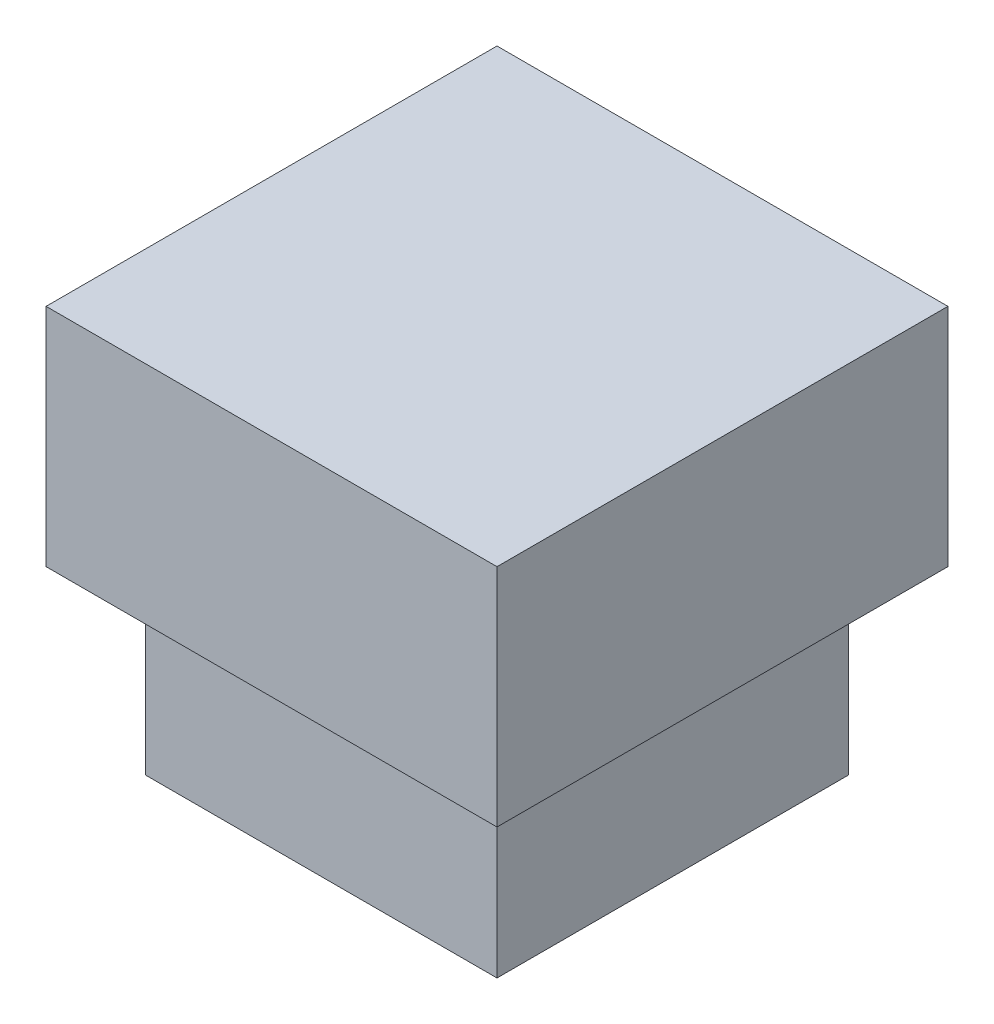
ISO-10303-21;
HEADER;
FILE_DESCRIPTION(('STEP AP214'),'2;1');
FILE_NAME('part.step','',(''),(''),'','','');
FILE_SCHEMA(('AUTOMOTIVE_DESIGN { 1 0 10303 214 1 1 1 1 }'));
ENDSEC;
DATA;
#1=APPLICATION_CONTEXT('core data for automotive mechanical design processes');
#2=APPLICATION_PROTOCOL_DEFINITION('international standard','automotive_design',2000,#1);
#3=PRODUCT_CONTEXT('',#1,'mechanical');
#4=PRODUCT('Part','Part','',(#3));
#5=PRODUCT_RELATED_PRODUCT_CATEGORY('part','',(#4));
#6=PRODUCT_DEFINITION_FORMATION('','',#4);
#7=PRODUCT_DEFINITION_CONTEXT('part definition',#1,'design');
#8=PRODUCT_DEFINITION('design','',#6,#7);
#9=PRODUCT_DEFINITION_SHAPE('','',#8);
#10=(LENGTH_UNIT() NAMED_UNIT(*) SI_UNIT(.MILLI.,.METRE.));
#11=(NAMED_UNIT(*) PLANE_ANGLE_UNIT() SI_UNIT($,.RADIAN.));
#12=(NAMED_UNIT(*) SI_UNIT($,.STERADIAN.) SOLID_ANGLE_UNIT());
#13=UNCERTAINTY_MEASURE_WITH_UNIT(LENGTH_MEASURE(1.E-05),#10,'distance_accuracy_value','');
#14=(GEOMETRIC_REPRESENTATION_CONTEXT(3) GLOBAL_UNCERTAINTY_ASSIGNED_CONTEXT((#13)) GLOBAL_UNIT_ASSIGNED_CONTEXT((#10,
#11,#12)) REPRESENTATION_CONTEXT('',''));
#15=CARTESIAN_POINT('',(0.,0.,0.));
#16=DIRECTION('',(0.,0.,1.));
#17=DIRECTION('',(1.,0.,0.));
#18=AXIS2_PLACEMENT_3D('',#15,#16,#17);
#19=CARTESIAN_POINT('',(1.95,2.,-1.95));
#20=DIRECTION('',(-1.,0.,0.));
#21=DIRECTION('',(0.,0.,1.));
#22=AXIS2_PLACEMENT_3D('',#19,#20,#21);
#23=PLANE('',#22);
#24=DIRECTION('',(0.,0.,-1.));
#25=VECTOR('',#24,1.);
#26=CARTESIAN_POINT('',(1.95,0.,-1.95));
#27=LINE('',#26,#25);
#28=CARTESIAN_POINT('',(1.95,0.,1.95));
#29=VERTEX_POINT('',#28);
#30=CARTESIAN_POINT('',(1.95,0.,-1.95));
#31=VERTEX_POINT('',#30);
#32=EDGE_CURVE('E133',#29,#31,#27,.T.);
#33=ORIENTED_EDGE('',*,*,#32,.T.);
#34=DIRECTION('',(0.,-1.,0.));
#35=VECTOR('',#34,1.);
#36=CARTESIAN_POINT('',(1.95,2.,-1.95));
#37=LINE('',#36,#35);
#38=CARTESIAN_POINT('',(1.95,2.,-1.95));
#39=VERTEX_POINT('',#38);
#40=EDGE_CURVE('E11',#39,#31,#37,.T.);
#41=ORIENTED_EDGE('',*,*,#40,.F.);
#42=DIRECTION('',(0.,0.,-1.));
#43=VECTOR('',#42,1.);
#44=CARTESIAN_POINT('',(1.95,2.,-1.95));
#45=LINE('',#44,#43);
#46=CARTESIAN_POINT('',(1.95,2.,1.95));
#47=VERTEX_POINT('',#46);
#48=EDGE_CURVE('E142',#47,#39,#45,.T.);
#49=ORIENTED_EDGE('',*,*,#48,.F.);
#50=DIRECTION('',(0.,-1.,0.));
#51=VECTOR('',#50,1.);
#52=CARTESIAN_POINT('',(1.95,2.,1.95));
#53=LINE('',#52,#51);
#54=EDGE_CURVE('E151',#47,#29,#53,.T.);
#55=ORIENTED_EDGE('',*,*,#54,.T.);
#56=EDGE_LOOP('',(#33,#41,#49,#55));
#57=FACE_BOUND('',#56,.T.);
#58=ADVANCED_FACE('F35',(#57),#23,.F.);
#59=CARTESIAN_POINT('',(-1.95,2.,-1.95));
#60=DIRECTION('',(0.,0.,1.));
#61=DIRECTION('',(1.,0.,0.));
#62=AXIS2_PLACEMENT_3D('',#59,#60,#61);
#63=PLANE('',#62);
#64=DIRECTION('',(-1.,0.,0.));
#65=VECTOR('',#64,1.);
#66=CARTESIAN_POINT('',(-1.95,0.,-1.95));
#67=LINE('',#66,#65);
#68=CARTESIAN_POINT('',(-1.95,0.,-1.95));
#69=VERTEX_POINT('',#68);
#70=EDGE_CURVE('E136',#31,#69,#67,.T.);
#71=ORIENTED_EDGE('',*,*,#70,.T.);
#72=DIRECTION('',(0.,-1.,0.));
#73=VECTOR('',#72,1.);
#74=CARTESIAN_POINT('',(-1.95,2.,-1.95));
#75=LINE('',#74,#73);
#76=CARTESIAN_POINT('',(-1.95,2.,-1.95));
#77=VERTEX_POINT('',#76);
#78=EDGE_CURVE('E43',#77,#69,#75,.T.);
#79=ORIENTED_EDGE('',*,*,#78,.F.);
#80=DIRECTION('',(-1.,0.,0.));
#81=VECTOR('',#80,1.);
#82=CARTESIAN_POINT('',(-1.95,2.,-1.95));
#83=LINE('',#82,#81);
#84=EDGE_CURVE('E77',#39,#77,#83,.T.);
#85=ORIENTED_EDGE('',*,*,#84,.F.);
#86=ORIENTED_EDGE('',*,*,#40,.T.);
#87=EDGE_LOOP('',(#71,#79,#85,#86));
#88=FACE_BOUND('',#87,.T.);
#89=ADVANCED_FACE('F177',(#88),#63,.F.);
#90=CARTESIAN_POINT('',(-1.95,2.,-1.95));
#91=DIRECTION('',(1.,0.,0.));
#92=DIRECTION('',(0.,0.,-1.));
#93=AXIS2_PLACEMENT_3D('',#90,#91,#92);
#94=PLANE('',#93);
#95=DIRECTION('',(0.,0.,1.));
#96=VECTOR('',#95,1.);
#97=CARTESIAN_POINT('',(-1.95,0.,-1.95));
#98=LINE('',#97,#96);
#99=CARTESIAN_POINT('',(-1.95,0.,1.95));
#100=VERTEX_POINT('',#99);
#101=EDGE_CURVE('E67',#69,#100,#98,.T.);
#102=ORIENTED_EDGE('',*,*,#101,.T.);
#103=DIRECTION('',(0.,-1.,0.));
#104=VECTOR('',#103,1.);
#105=CARTESIAN_POINT('',(-1.95,2.,1.95));
#106=LINE('',#105,#104);
#107=CARTESIAN_POINT('',(-1.95,2.,1.95));
#108=VERTEX_POINT('',#107);
#109=EDGE_CURVE('E51',#108,#100,#106,.T.);
#110=ORIENTED_EDGE('',*,*,#109,.F.);
#111=DIRECTION('',(0.,0.,1.));
#112=VECTOR('',#111,1.);
#113=CARTESIAN_POINT('',(-1.95,2.,-1.95));
#114=LINE('',#113,#112);
#115=EDGE_CURVE('E146',#77,#108,#114,.T.);
#116=ORIENTED_EDGE('',*,*,#115,.F.);
#117=ORIENTED_EDGE('',*,*,#78,.T.);
#118=EDGE_LOOP('',(#102,#110,#116,#117));
#119=FACE_BOUND('',#118,.T.);
#120=ADVANCED_FACE('F157',(#119),#94,.F.);
#121=CARTESIAN_POINT('',(-1.95,2.,1.95));
#122=DIRECTION('',(0.,0.,-1.));
#123=DIRECTION('',(-1.,0.,0.));
#124=AXIS2_PLACEMENT_3D('',#121,#122,#123);
#125=PLANE('',#124);
#126=DIRECTION('',(1.,0.,0.));
#127=VECTOR('',#126,1.);
#128=CARTESIAN_POINT('',(-1.95,0.,1.95));
#129=LINE('',#128,#127);
#130=EDGE_CURVE('E72',#100,#29,#129,.T.);
#131=ORIENTED_EDGE('',*,*,#130,.T.);
#132=ORIENTED_EDGE('',*,*,#54,.F.);
#133=DIRECTION('',(1.,0.,0.));
#134=VECTOR('',#133,1.);
#135=CARTESIAN_POINT('',(-1.95,2.,1.95));
#136=LINE('',#135,#134);
#137=EDGE_CURVE('E149',#108,#47,#136,.T.);
#138=ORIENTED_EDGE('',*,*,#137,.F.);
#139=ORIENTED_EDGE('',*,*,#109,.T.);
#140=EDGE_LOOP('',(#131,#132,#138,#139));
#141=FACE_BOUND('',#140,.T.);
#142=ADVANCED_FACE('F162',(#141),#125,.F.);
#143=CARTESIAN_POINT('',(0.,0.,0.));
#144=DIRECTION('',(0.,1.,0.));
#145=DIRECTION('',(0.,0.,1.));
#146=AXIS2_PLACEMENT_3D('',#143,#144,#145);
#147=PLANE('',#146);
#148=ORIENTED_EDGE('',*,*,#32,.F.);
#149=ORIENTED_EDGE('',*,*,#130,.F.);
#150=ORIENTED_EDGE('',*,*,#101,.F.);
#151=ORIENTED_EDGE('',*,*,#70,.F.);
#152=EDGE_LOOP('',(#148,#149,#150,#151));
#153=FACE_BOUND('',#152,.T.);
#154=ADVANCED_FACE('F160',(#153),#147,.F.);
#155=CARTESIAN_POINT('',(0.,2.,0.));
#156=DIRECTION('',(0.,1.,0.));
#157=DIRECTION('',(0.,0.,1.));
#158=AXIS2_PLACEMENT_3D('',#155,#156,#157);
#159=PLANE('',#158);
#160=DIRECTION('',(0.,0.,-1.));
#161=VECTOR('',#160,1.);
#162=CARTESIAN_POINT('',(2.5,2.,-2.5));
#163=LINE('',#162,#161);
#164=CARTESIAN_POINT('',(2.5,2.,2.5));
#165=VERTEX_POINT('',#164);
#166=CARTESIAN_POINT('',(2.5,2.,-2.5));
#167=VERTEX_POINT('',#166);
#168=EDGE_CURVE('E132',#165,#167,#163,.T.);
#169=ORIENTED_EDGE('',*,*,#168,.F.);
#170=DIRECTION('',(1.,0.,0.));
#171=VECTOR('',#170,1.);
#172=CARTESIAN_POINT('',(-2.5,2.,2.5));
#173=LINE('',#172,#171);
#174=CARTESIAN_POINT('',(-2.5,2.,2.5));
#175=VERTEX_POINT('',#174);
#176=EDGE_CURVE('E128',#175,#165,#173,.T.);
#177=ORIENTED_EDGE('',*,*,#176,.F.);
#178=DIRECTION('',(0.,0.,1.));
#179=VECTOR('',#178,1.);
#180=CARTESIAN_POINT('',(-2.5,2.,-2.5));
#181=LINE('',#180,#179);
#182=CARTESIAN_POINT('',(-2.5,2.,-2.5));
#183=VERTEX_POINT('',#182);
#184=EDGE_CURVE('E204',#183,#175,#181,.T.);
#185=ORIENTED_EDGE('',*,*,#184,.F.);
#186=DIRECTION('',(-1.,0.,0.));
#187=VECTOR('',#186,1.);
#188=CARTESIAN_POINT('',(-2.5,2.,-2.5));
#189=LINE('',#188,#187);
#190=EDGE_CURVE('E207',#167,#183,#189,.T.);
#191=ORIENTED_EDGE('',*,*,#190,.F.);
#192=EDGE_LOOP('',(#169,#177,#185,#191));
#193=FACE_BOUND('',#192,.T.);
#194=ORIENTED_EDGE('',*,*,#137,.T.);
#195=ORIENTED_EDGE('',*,*,#48,.T.);
#196=ORIENTED_EDGE('',*,*,#84,.T.);
#197=ORIENTED_EDGE('',*,*,#115,.T.);
#198=EDGE_LOOP('',(#194,#195,#196,#197));
#199=FACE_BOUND('',#198,.T.);
#200=ADVANCED_FACE('F164',(#193,#199),#159,.F.);
#201=CARTESIAN_POINT('',(2.5,4.5,-2.5));
#202=DIRECTION('',(-1.,0.,0.));
#203=DIRECTION('',(0.,0.,1.));
#204=AXIS2_PLACEMENT_3D('',#201,#202,#203);
#205=PLANE('',#204);
#206=ORIENTED_EDGE('',*,*,#168,.T.);
#207=DIRECTION('',(0.,-1.,0.));
#208=VECTOR('',#207,1.);
#209=CARTESIAN_POINT('',(2.5,4.5,-2.5));
#210=LINE('',#209,#208);
#211=CARTESIAN_POINT('',(2.5,4.5,-2.5));
#212=VERTEX_POINT('',#211);
#213=EDGE_CURVE('E112',#212,#167,#210,.T.);
#214=ORIENTED_EDGE('',*,*,#213,.F.);
#215=DIRECTION('',(0.,0.,-1.));
#216=VECTOR('',#215,1.);
#217=CARTESIAN_POINT('',(2.5,4.5,-2.5));
#218=LINE('',#217,#216);
#219=CARTESIAN_POINT('',(2.5,4.5,2.5));
#220=VERTEX_POINT('',#219);
#221=EDGE_CURVE('E119',#220,#212,#218,.T.);
#222=ORIENTED_EDGE('',*,*,#221,.F.);
#223=DIRECTION('',(0.,-1.,0.));
#224=VECTOR('',#223,1.);
#225=CARTESIAN_POINT('',(2.5,4.5,2.5));
#226=LINE('',#225,#224);
#227=EDGE_CURVE('E201',#220,#165,#226,.T.);
#228=ORIENTED_EDGE('',*,*,#227,.T.);
#229=EDGE_LOOP('',(#206,#214,#222,#228));
#230=FACE_BOUND('',#229,.T.);
#231=ADVANCED_FACE('F130',(#230),#205,.F.);
#232=CARTESIAN_POINT('',(-2.5,4.5,-2.5));
#233=DIRECTION('',(0.,0.,1.));
#234=DIRECTION('',(1.,0.,0.));
#235=AXIS2_PLACEMENT_3D('',#232,#233,#234);
#236=PLANE('',#235);
#237=ORIENTED_EDGE('',*,*,#190,.T.);
#238=DIRECTION('',(0.,-1.,0.));
#239=VECTOR('',#238,1.);
#240=CARTESIAN_POINT('',(-2.5,4.5,-2.5));
#241=LINE('',#240,#239);
#242=CARTESIAN_POINT('',(-2.5,4.5,-2.5));
#243=VERTEX_POINT('',#242);
#244=EDGE_CURVE('E115',#243,#183,#241,.T.);
#245=ORIENTED_EDGE('',*,*,#244,.F.);
#246=DIRECTION('',(-1.,0.,0.));
#247=VECTOR('',#246,1.);
#248=CARTESIAN_POINT('',(-2.5,4.5,-2.5));
#249=LINE('',#248,#247);
#250=EDGE_CURVE('E108',#212,#243,#249,.T.);
#251=ORIENTED_EDGE('',*,*,#250,.F.);
#252=ORIENTED_EDGE('',*,*,#213,.T.);
#253=EDGE_LOOP('',(#237,#245,#251,#252));
#254=FACE_BOUND('',#253,.T.);
#255=ADVANCED_FACE('F110',(#254),#236,.F.);
#256=CARTESIAN_POINT('',(-2.5,4.5,-2.5));
#257=DIRECTION('',(1.,0.,0.));
#258=DIRECTION('',(0.,0.,-1.));
#259=AXIS2_PLACEMENT_3D('',#256,#257,#258);
#260=PLANE('',#259);
#261=ORIENTED_EDGE('',*,*,#184,.T.);
#262=DIRECTION('',(0.,-1.,0.));
#263=VECTOR('',#262,1.);
#264=CARTESIAN_POINT('',(-2.5,4.5,2.5));
#265=LINE('',#264,#263);
#266=CARTESIAN_POINT('',(-2.5,4.5,2.5));
#267=VERTEX_POINT('',#266);
#268=EDGE_CURVE('E138',#267,#175,#265,.T.);
#269=ORIENTED_EDGE('',*,*,#268,.F.);
#270=DIRECTION('',(0.,0.,1.));
#271=VECTOR('',#270,1.);
#272=CARTESIAN_POINT('',(-2.5,4.5,-2.5));
#273=LINE('',#272,#271);
#274=EDGE_CURVE('E118',#243,#267,#273,.T.);
#275=ORIENTED_EDGE('',*,*,#274,.F.);
#276=ORIENTED_EDGE('',*,*,#244,.T.);
#277=EDGE_LOOP('',(#261,#269,#275,#276));
#278=FACE_BOUND('',#277,.T.);
#279=ADVANCED_FACE('F190',(#278),#260,.F.);
#280=CARTESIAN_POINT('',(-2.5,4.5,2.5));
#281=DIRECTION('',(0.,0.,-1.));
#282=DIRECTION('',(-1.,0.,0.));
#283=AXIS2_PLACEMENT_3D('',#280,#281,#282);
#284=PLANE('',#283);
#285=ORIENTED_EDGE('',*,*,#176,.T.);
#286=ORIENTED_EDGE('',*,*,#227,.F.);
#287=DIRECTION('',(1.,0.,0.));
#288=VECTOR('',#287,1.);
#289=CARTESIAN_POINT('',(-2.5,4.5,2.5));
#290=LINE('',#289,#288);
#291=EDGE_CURVE('E124',#267,#220,#290,.T.);
#292=ORIENTED_EDGE('',*,*,#291,.F.);
#293=ORIENTED_EDGE('',*,*,#268,.T.);
#294=EDGE_LOOP('',(#285,#286,#292,#293));
#295=FACE_BOUND('',#294,.T.);
#296=ADVANCED_FACE('F192',(#295),#284,.F.);
#297=CARTESIAN_POINT('',(0.,4.5,0.));
#298=DIRECTION('',(0.,1.,0.));
#299=DIRECTION('',(0.,0.,1.));
#300=AXIS2_PLACEMENT_3D('',#297,#298,#299);
#301=PLANE('',#300);
#302=ORIENTED_EDGE('',*,*,#221,.T.);
#303=ORIENTED_EDGE('',*,*,#250,.T.);
#304=ORIENTED_EDGE('',*,*,#274,.T.);
#305=ORIENTED_EDGE('',*,*,#291,.T.);
#306=EDGE_LOOP('',(#302,#303,#304,#305));
#307=FACE_BOUND('',#306,.T.);
#308=ADVANCED_FACE('F122',(#307),#301,.T.);
#309=CLOSED_SHELL('',(#58,#89,#120,#142,#154,#200,#231,#255,#279,#296,#308));
#310=MANIFOLD_SOLID_BREP('B2',#309);
#311=ADVANCED_BREP_SHAPE_REPRESENTATION('',(#18,#310),#14);
#312=SHAPE_DEFINITION_REPRESENTATION(#9,#311);
ENDSEC;
END-ISO-10303-21;
